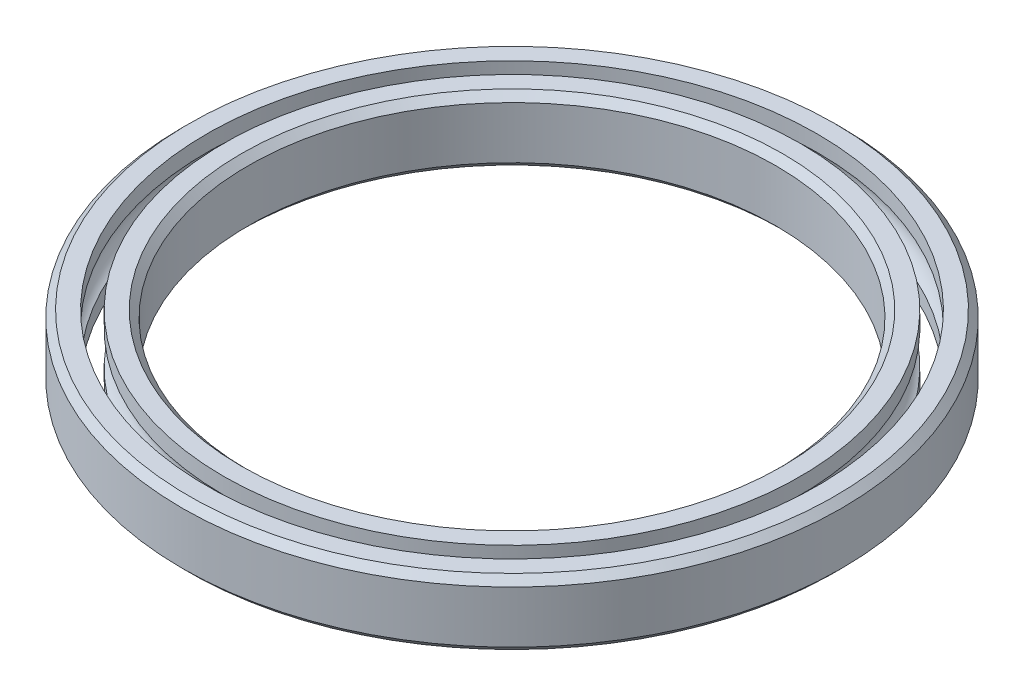
ISO-10303-21;
HEADER;
FILE_DESCRIPTION(('STEP AP214'),'2;1');
FILE_NAME('part.step','',(''),(''),'','','');
FILE_SCHEMA(('AUTOMOTIVE_DESIGN { 1 0 10303 214 1 1 1 1 }'));
ENDSEC;
DATA;
#1=APPLICATION_CONTEXT('core data for automotive mechanical design processes');
#2=APPLICATION_PROTOCOL_DEFINITION('international standard','automotive_design',2000,#1);
#3=PRODUCT_CONTEXT('',#1,'mechanical');
#4=PRODUCT('Part','Part','',(#3));
#5=PRODUCT_RELATED_PRODUCT_CATEGORY('part','',(#4));
#6=PRODUCT_DEFINITION_FORMATION('','',#4);
#7=PRODUCT_DEFINITION_CONTEXT('part definition',#1,'design');
#8=PRODUCT_DEFINITION('design','',#6,#7);
#9=PRODUCT_DEFINITION_SHAPE('','',#8);
#10=(LENGTH_UNIT() NAMED_UNIT(*) SI_UNIT(.MILLI.,.METRE.));
#11=(NAMED_UNIT(*) PLANE_ANGLE_UNIT() SI_UNIT($,.RADIAN.));
#12=(NAMED_UNIT(*) SI_UNIT($,.STERADIAN.) SOLID_ANGLE_UNIT());
#13=UNCERTAINTY_MEASURE_WITH_UNIT(LENGTH_MEASURE(1.E-05),#10,'distance_accuracy_value','');
#14=(GEOMETRIC_REPRESENTATION_CONTEXT(3) GLOBAL_UNCERTAINTY_ASSIGNED_CONTEXT((#13)) GLOBAL_UNIT_ASSIGNED_CONTEXT((#10,
#11,#12)) REPRESENTATION_CONTEXT('',''));
#15=CARTESIAN_POINT('',(0.,0.,0.));
#16=DIRECTION('',(0.,0.,1.));
#17=DIRECTION('',(1.,0.,0.));
#18=AXIS2_PLACEMENT_3D('',#15,#16,#17);
#19=CARTESIAN_POINT('',(0.,0.,0.));
#20=DIRECTION('',(0.,-1.,0.));
#21=DIRECTION('',(0.,0.,-1.));
#22=AXIS2_PLACEMENT_3D('',#19,#20,#21);
#23=CYLINDRICAL_SURFACE('',#22,19.05);
#24=CARTESIAN_POINT('',(0.,1.88125,0.));
#25=DIRECTION('',(0.,-1.,0.));
#26=DIRECTION('',(0.,0.,-1.));
#27=AXIS2_PLACEMENT_3D('',#24,#25,#26);
#28=CIRCLE('',#27,19.05);
#29=CARTESIAN_POINT('',(0.,1.88125,-19.05));
#30=VERTEX_POINT('',#29);
#31=EDGE_CURVE('E11',#30,#30,#28,.T.);
#32=ORIENTED_EDGE('',*,*,#31,.F.);
#33=EDGE_LOOP('',(#32));
#34=FACE_BOUND('',#33,.T.);
#35=CARTESIAN_POINT('',(0.,-1.88125,0.));
#36=DIRECTION('',(0.,-1.,0.));
#37=DIRECTION('',(0.,0.,-1.));
#38=AXIS2_PLACEMENT_3D('',#35,#36,#37);
#39=CIRCLE('',#38,19.05);
#40=CARTESIAN_POINT('',(0.,-1.88125,-19.05));
#41=VERTEX_POINT('',#40);
#42=EDGE_CURVE('E65',#41,#41,#39,.T.);
#43=ORIENTED_EDGE('',*,*,#42,.T.);
#44=EDGE_LOOP('',(#43));
#45=FACE_BOUND('',#44,.T.);
#46=ADVANCED_FACE('F37',(#34,#45),#23,.F.);
#47=CARTESIAN_POINT('',(0.,1.88125,0.));
#48=DIRECTION('',(0.,1.,0.));
#49=DIRECTION('',(0.,0.,1.));
#50=AXIS2_PLACEMENT_3D('',#47,#48,#49);
#51=CONICAL_SURFACE('',#50,19.05,0.785398163397444);
#52=CARTESIAN_POINT('',(0.,2.38125,0.));
#53=DIRECTION('',(0.,-1.,0.));
#54=DIRECTION('',(0.,0.,-1.));
#55=AXIS2_PLACEMENT_3D('',#52,#53,#54);
#56=CIRCLE('',#55,19.55);
#57=CARTESIAN_POINT('',(0.,2.38125,-19.55));
#58=VERTEX_POINT('',#57);
#59=EDGE_CURVE('E43',#58,#58,#56,.T.);
#60=ORIENTED_EDGE('',*,*,#59,.F.);
#61=EDGE_LOOP('',(#60));
#62=FACE_BOUND('',#61,.T.);
#63=ORIENTED_EDGE('',*,*,#31,.T.);
#64=EDGE_LOOP('',(#63));
#65=FACE_BOUND('',#64,.T.);
#66=ADVANCED_FACE('F102',(#62,#65),#51,.F.);
#67=CARTESIAN_POINT('',(-19.55,2.38125,0.));
#68=DIRECTION('',(0.,-1.,0.));
#69=DIRECTION('',(0.,0.,-1.));
#70=AXIS2_PLACEMENT_3D('',#67,#68,#69);
#71=PLANE('',#70);
#72=CARTESIAN_POINT('',(0.,2.38125,0.));
#73=DIRECTION('',(0.,-1.,0.));
#74=DIRECTION('',(0.,0.,-1.));
#75=AXIS2_PLACEMENT_3D('',#72,#73,#74);
#76=CIRCLE('',#75,20.828);
#77=CARTESIAN_POINT('',(0.,2.38125,-20.828));
#78=VERTEX_POINT('',#77);
#79=EDGE_CURVE('E47',#78,#78,#76,.T.);
#80=ORIENTED_EDGE('',*,*,#79,.F.);
#81=EDGE_LOOP('',(#80));
#82=FACE_BOUND('',#81,.T.);
#83=ORIENTED_EDGE('',*,*,#59,.T.);
#84=EDGE_LOOP('',(#83));
#85=FACE_BOUND('',#84,.T.);
#86=ADVANCED_FACE('F97',(#82,#85),#71,.F.);
#87=CARTESIAN_POINT('',(0.,0.,0.));
#88=DIRECTION('',(0.,-1.,0.));
#89=DIRECTION('',(0.,0.,-1.));
#90=AXIS2_PLACEMENT_3D('',#87,#88,#89);
#91=CYLINDRICAL_SURFACE('',#90,20.828);
#92=CARTESIAN_POINT('',(0.,1.21799580072345,0.));
#93=DIRECTION('',(0.,-1.,0.));
#94=DIRECTION('',(0.,0.,-1.));
#95=AXIS2_PLACEMENT_3D('',#92,#93,#94);
#96=CIRCLE('',#95,20.828);
#97=CARTESIAN_POINT('',(0.,1.21799580072345,-20.828));
#98=VERTEX_POINT('',#97);
#99=EDGE_CURVE('E51',#98,#98,#96,.T.);
#100=ORIENTED_EDGE('',*,*,#99,.F.);
#101=EDGE_LOOP('',(#100));
#102=FACE_BOUND('',#101,.T.);
#103=ORIENTED_EDGE('',*,*,#79,.T.);
#104=EDGE_LOOP('',(#103));
#105=FACE_BOUND('',#104,.T.);
#106=ADVANCED_FACE('F91',(#102,#105),#91,.T.);
#107=CARTESIAN_POINT('',(0.,0.,0.));
#108=DIRECTION('',(0.,-1.,0.));
#109=DIRECTION('',(0.,0.,-1.));
#110=AXIS2_PLACEMENT_3D('',#107,#108,#109);
#111=TOROIDAL_SURFACE('',#110,21.43125,1.35919988709533);
#112=CARTESIAN_POINT('',(0.,-1.21799580072345,0.));
#113=DIRECTION('',(0.,-1.,0.));
#114=DIRECTION('',(0.,0.,-1.));
#115=AXIS2_PLACEMENT_3D('',#112,#113,#114);
#116=CIRCLE('',#115,20.828);
#117=CARTESIAN_POINT('',(0.,-1.21799580072345,-20.828));
#118=VERTEX_POINT('',#117);
#119=EDGE_CURVE('E56',#118,#118,#116,.T.);
#120=ORIENTED_EDGE('',*,*,#119,.F.);
#121=EDGE_LOOP('',(#120));
#122=FACE_BOUND('',#121,.T.);
#123=ORIENTED_EDGE('',*,*,#99,.T.);
#124=EDGE_LOOP('',(#123));
#125=FACE_BOUND('',#124,.T.);
#126=ADVANCED_FACE('F85',(#122,#125),#111,.F.);
#127=CARTESIAN_POINT('',(0.,0.,0.));
#128=DIRECTION('',(0.,-1.,0.));
#129=DIRECTION('',(0.,0.,-1.));
#130=AXIS2_PLACEMENT_3D('',#127,#128,#129);
#131=CYLINDRICAL_SURFACE('',#130,20.828);
#132=CARTESIAN_POINT('',(0.,-2.38125,0.));
#133=DIRECTION('',(0.,-1.,0.));
#134=DIRECTION('',(0.,0.,-1.));
#135=AXIS2_PLACEMENT_3D('',#132,#133,#134);
#136=CIRCLE('',#135,20.828);
#137=CARTESIAN_POINT('',(0.,-2.38125,-20.828));
#138=VERTEX_POINT('',#137);
#139=EDGE_CURVE('E59',#138,#138,#136,.T.);
#140=ORIENTED_EDGE('',*,*,#139,.F.);
#141=EDGE_LOOP('',(#140));
#142=FACE_BOUND('',#141,.T.);
#143=ORIENTED_EDGE('',*,*,#119,.T.);
#144=EDGE_LOOP('',(#143));
#145=FACE_BOUND('',#144,.T.);
#146=ADVANCED_FACE('F79',(#142,#145),#131,.T.);
#147=CARTESIAN_POINT('',(-19.55,-2.38125,0.));
#148=DIRECTION('',(0.,1.,0.));
#149=DIRECTION('',(0.,0.,1.));
#150=AXIS2_PLACEMENT_3D('',#147,#148,#149);
#151=PLANE('',#150);
#152=CARTESIAN_POINT('',(0.,-2.38125,0.));
#153=DIRECTION('',(0.,-1.,0.));
#154=DIRECTION('',(0.,0.,-1.));
#155=AXIS2_PLACEMENT_3D('',#152,#153,#154);
#156=CIRCLE('',#155,19.55);
#157=CARTESIAN_POINT('',(0.,-2.38125,-19.55));
#158=VERTEX_POINT('',#157);
#159=EDGE_CURVE('E62',#158,#158,#156,.T.);
#160=ORIENTED_EDGE('',*,*,#159,.F.);
#161=EDGE_LOOP('',(#160));
#162=FACE_BOUND('',#161,.T.);
#163=ORIENTED_EDGE('',*,*,#139,.T.);
#164=EDGE_LOOP('',(#163));
#165=FACE_BOUND('',#164,.T.);
#166=ADVANCED_FACE('F73',(#162,#165),#151,.F.);
#167=CARTESIAN_POINT('',(0.,-2.38125,0.));
#168=DIRECTION('',(0.,-1.,0.));
#169=DIRECTION('',(0.,0.,-1.));
#170=AXIS2_PLACEMENT_3D('',#167,#168,#169);
#171=CONICAL_SURFACE('',#170,19.55,0.785398163397444);
#172=ORIENTED_EDGE('',*,*,#42,.F.);
#173=EDGE_LOOP('',(#172));
#174=FACE_BOUND('',#173,.T.);
#175=ORIENTED_EDGE('',*,*,#159,.T.);
#176=EDGE_LOOP('',(#175));
#177=FACE_BOUND('',#176,.T.);
#178=ADVANCED_FACE('F70',(#174,#177),#171,.F.);
#179=CLOSED_SHELL('',(#46,#66,#86,#106,#126,#146,#166,#178));
#180=MANIFOLD_SOLID_BREP('B2',#179);
#181=CARTESIAN_POINT('',(0.,-1.88124999999999,0.));
#182=DIRECTION('',(0.,1.,0.));
#183=DIRECTION('',(0.,0.,1.));
#184=AXIS2_PLACEMENT_3D('',#181,#182,#183);
#185=CONICAL_SURFACE('',#184,23.8125,0.785398163397443);
#186=CARTESIAN_POINT('',(0.,-2.38125,0.));
#187=DIRECTION('',(0.,-1.,0.));
#188=DIRECTION('',(0.,0.,-1.));
#189=AXIS2_PLACEMENT_3D('',#186,#187,#188);
#190=CIRCLE('',#189,23.3125);
#191=CARTESIAN_POINT('',(0.,-2.38125,-23.3125));
#192=VERTEX_POINT('',#191);
#193=EDGE_CURVE('E187',#192,#192,#190,.T.);
#194=ORIENTED_EDGE('',*,*,#193,.F.);
#195=EDGE_LOOP('',(#194));
#196=FACE_BOUND('',#195,.T.);
#197=CARTESIAN_POINT('',(0.,-1.88124999999999,0.));
#198=DIRECTION('',(0.,-1.,0.));
#199=DIRECTION('',(0.,0.,-1.));
#200=AXIS2_PLACEMENT_3D('',#197,#198,#199);
#201=CIRCLE('',#200,23.8125);
#202=CARTESIAN_POINT('',(0.,-1.88124999999999,-23.8125));
#203=VERTEX_POINT('',#202);
#204=EDGE_CURVE('E36',#203,#203,#201,.T.);
#205=ORIENTED_EDGE('',*,*,#204,.T.);
#206=EDGE_LOOP('',(#205));
#207=FACE_BOUND('',#206,.T.);
#208=ADVANCED_FACE('F159',(#196,#207),#185,.T.);
#209=CARTESIAN_POINT('',(0.,0.,0.));
#210=DIRECTION('',(0.,-1.,0.));
#211=DIRECTION('',(0.,0.,-1.));
#212=AXIS2_PLACEMENT_3D('',#209,#210,#211);
#213=CYLINDRICAL_SURFACE('',#212,23.8125);
#214=ORIENTED_EDGE('',*,*,#204,.F.);
#215=EDGE_LOOP('',(#214));
#216=FACE_BOUND('',#215,.T.);
#217=CARTESIAN_POINT('',(0.,1.88124999999999,0.));
#218=DIRECTION('',(0.,-1.,0.));
#219=DIRECTION('',(0.,0.,-1.));
#220=AXIS2_PLACEMENT_3D('',#217,#218,#219);
#221=CIRCLE('',#220,23.8125);
#222=CARTESIAN_POINT('',(0.,1.88124999999999,-23.8125));
#223=VERTEX_POINT('',#222);
#224=EDGE_CURVE('E165',#223,#223,#221,.T.);
#225=ORIENTED_EDGE('',*,*,#224,.T.);
#226=EDGE_LOOP('',(#225));
#227=FACE_BOUND('',#226,.T.);
#228=ADVANCED_FACE('F194',(#216,#227),#213,.T.);
#229=CARTESIAN_POINT('',(0.,2.38125,0.));
#230=DIRECTION('',(0.,-1.,0.));
#231=DIRECTION('',(0.,0.,-1.));
#232=AXIS2_PLACEMENT_3D('',#229,#230,#231);
#233=CONICAL_SURFACE('',#232,23.3125,0.785398163397443);
#234=ORIENTED_EDGE('',*,*,#224,.F.);
#235=EDGE_LOOP('',(#234));
#236=FACE_BOUND('',#235,.T.);
#237=CARTESIAN_POINT('',(0.,2.38125,0.));
#238=DIRECTION('',(0.,-1.,0.));
#239=DIRECTION('',(0.,0.,-1.));
#240=AXIS2_PLACEMENT_3D('',#237,#238,#239);
#241=CIRCLE('',#240,23.3125);
#242=CARTESIAN_POINT('',(0.,2.38125,-23.3125));
#243=VERTEX_POINT('',#242);
#244=EDGE_CURVE('E169',#243,#243,#241,.T.);
#245=ORIENTED_EDGE('',*,*,#244,.T.);
#246=EDGE_LOOP('',(#245));
#247=FACE_BOUND('',#246,.T.);
#248=ADVANCED_FACE('F198',(#236,#247),#233,.T.);
#249=CARTESIAN_POINT('',(-23.3125,2.38125,0.));
#250=DIRECTION('',(0.,-1.,0.));
#251=DIRECTION('',(0.,0.,-1.));
#252=AXIS2_PLACEMENT_3D('',#249,#250,#251);
#253=PLANE('',#252);
#254=ORIENTED_EDGE('',*,*,#244,.F.);
#255=EDGE_LOOP('',(#254));
#256=FACE_BOUND('',#255,.T.);
#257=CARTESIAN_POINT('',(0.,2.38125,0.));
#258=DIRECTION('',(0.,-1.,0.));
#259=DIRECTION('',(0.,0.,-1.));
#260=AXIS2_PLACEMENT_3D('',#257,#258,#259);
#261=CIRCLE('',#260,22.0345);
#262=CARTESIAN_POINT('',(0.,2.38125,-22.0345));
#263=VERTEX_POINT('',#262);
#264=EDGE_CURVE('E173',#263,#263,#261,.T.);
#265=ORIENTED_EDGE('',*,*,#264,.T.);
#266=EDGE_LOOP('',(#265));
#267=FACE_BOUND('',#266,.T.);
#268=ADVANCED_FACE('F203',(#256,#267),#253,.F.);
#269=CARTESIAN_POINT('',(0.,0.,0.));
#270=DIRECTION('',(0.,-1.,0.));
#271=DIRECTION('',(0.,0.,-1.));
#272=AXIS2_PLACEMENT_3D('',#269,#270,#271);
#273=CYLINDRICAL_SURFACE('',#272,22.0345);
#274=ORIENTED_EDGE('',*,*,#264,.F.);
#275=EDGE_LOOP('',(#274));
#276=FACE_BOUND('',#275,.T.);
#277=CARTESIAN_POINT('',(0.,1.21799580072345,0.));
#278=DIRECTION('',(0.,-1.,0.));
#279=DIRECTION('',(0.,0.,-1.));
#280=AXIS2_PLACEMENT_3D('',#277,#278,#279);
#281=CIRCLE('',#280,22.0345);
#282=CARTESIAN_POINT('',(0.,1.21799580072345,-22.0345));
#283=VERTEX_POINT('',#282);
#284=EDGE_CURVE('E178',#283,#283,#281,.T.);
#285=ORIENTED_EDGE('',*,*,#284,.T.);
#286=EDGE_LOOP('',(#285));
#287=FACE_BOUND('',#286,.T.);
#288=ADVANCED_FACE('F209',(#276,#287),#273,.F.);
#289=CARTESIAN_POINT('',(0.,0.,0.));
#290=DIRECTION('',(0.,-1.,0.));
#291=DIRECTION('',(0.,0.,-1.));
#292=AXIS2_PLACEMENT_3D('',#289,#290,#291);
#293=TOROIDAL_SURFACE('',#292,21.43125,1.35919988709533);
#294=ORIENTED_EDGE('',*,*,#284,.F.);
#295=EDGE_LOOP('',(#294));
#296=FACE_BOUND('',#295,.T.);
#297=CARTESIAN_POINT('',(0.,-1.21799580072345,0.));
#298=DIRECTION('',(0.,-1.,0.));
#299=DIRECTION('',(0.,0.,-1.));
#300=AXIS2_PLACEMENT_3D('',#297,#298,#299);
#301=CIRCLE('',#300,22.0345);
#302=CARTESIAN_POINT('',(0.,-1.21799580072345,-22.0345));
#303=VERTEX_POINT('',#302);
#304=EDGE_CURVE('E181',#303,#303,#301,.T.);
#305=ORIENTED_EDGE('',*,*,#304,.T.);
#306=EDGE_LOOP('',(#305));
#307=FACE_BOUND('',#306,.T.);
#308=ADVANCED_FACE('F213',(#296,#307),#293,.F.);
#309=CARTESIAN_POINT('',(0.,0.,0.));
#310=DIRECTION('',(0.,-1.,0.));
#311=DIRECTION('',(0.,0.,-1.));
#312=AXIS2_PLACEMENT_3D('',#309,#310,#311);
#313=CYLINDRICAL_SURFACE('',#312,22.0345);
#314=ORIENTED_EDGE('',*,*,#304,.F.);
#315=EDGE_LOOP('',(#314));
#316=FACE_BOUND('',#315,.T.);
#317=CARTESIAN_POINT('',(0.,-2.38125,0.));
#318=DIRECTION('',(0.,-1.,0.));
#319=DIRECTION('',(0.,0.,-1.));
#320=AXIS2_PLACEMENT_3D('',#317,#318,#319);
#321=CIRCLE('',#320,22.0345);
#322=CARTESIAN_POINT('',(0.,-2.38125,-22.0345));
#323=VERTEX_POINT('',#322);
#324=EDGE_CURVE('E184',#323,#323,#321,.T.);
#325=ORIENTED_EDGE('',*,*,#324,.T.);
#326=EDGE_LOOP('',(#325));
#327=FACE_BOUND('',#326,.T.);
#328=ADVANCED_FACE('F217',(#316,#327),#313,.F.);
#329=CARTESIAN_POINT('',(-23.3125,-2.38125,0.));
#330=DIRECTION('',(0.,1.,0.));
#331=DIRECTION('',(0.,0.,1.));
#332=AXIS2_PLACEMENT_3D('',#329,#330,#331);
#333=PLANE('',#332);
#334=ORIENTED_EDGE('',*,*,#324,.F.);
#335=EDGE_LOOP('',(#334));
#336=FACE_BOUND('',#335,.T.);
#337=ORIENTED_EDGE('',*,*,#193,.T.);
#338=EDGE_LOOP('',(#337));
#339=FACE_BOUND('',#338,.T.);
#340=ADVANCED_FACE('F191',(#336,#339),#333,.F.);
#341=CLOSED_SHELL('',(#208,#228,#248,#268,#288,#308,#328,#340));
#342=MANIFOLD_SOLID_BREP('B6',#341);
#343=ADVANCED_BREP_SHAPE_REPRESENTATION('',(#18,#180,#342),#14);
#344=SHAPE_DEFINITION_REPRESENTATION(#9,#343);
ENDSEC;
END-ISO-10303-21;
